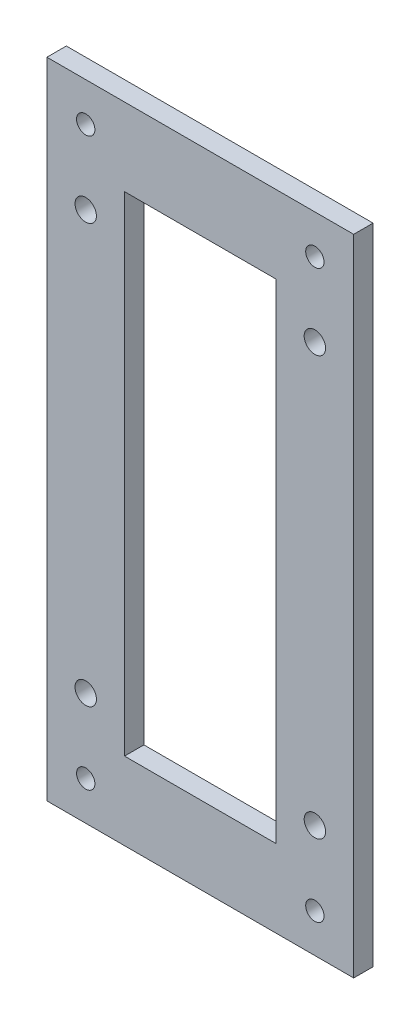
ISO-10303-21;
HEADER;
FILE_DESCRIPTION(('STEP AP214'),'2;1');
FILE_NAME('part.step','',(''),(''),'','','');
FILE_SCHEMA(('AUTOMOTIVE_DESIGN { 1 0 10303 214 1 1 1 1 }'));
ENDSEC;
DATA;
#1=APPLICATION_CONTEXT('core data for automotive mechanical design processes');
#2=APPLICATION_PROTOCOL_DEFINITION('international standard','automotive_design',2000,#1);
#3=PRODUCT_CONTEXT('',#1,'mechanical');
#4=PRODUCT('Part','Part','',(#3));
#5=PRODUCT_RELATED_PRODUCT_CATEGORY('part','',(#4));
#6=PRODUCT_DEFINITION_FORMATION('','',#4);
#7=PRODUCT_DEFINITION_CONTEXT('part definition',#1,'design');
#8=PRODUCT_DEFINITION('design','',#6,#7);
#9=PRODUCT_DEFINITION_SHAPE('','',#8);
#10=(LENGTH_UNIT() NAMED_UNIT(*) SI_UNIT(.MILLI.,.METRE.));
#11=(NAMED_UNIT(*) PLANE_ANGLE_UNIT() SI_UNIT($,.RADIAN.));
#12=(NAMED_UNIT(*) SI_UNIT($,.STERADIAN.) SOLID_ANGLE_UNIT());
#13=UNCERTAINTY_MEASURE_WITH_UNIT(LENGTH_MEASURE(1.E-05),#10,'distance_accuracy_value','');
#14=(GEOMETRIC_REPRESENTATION_CONTEXT(3) GLOBAL_UNCERTAINTY_ASSIGNED_CONTEXT((#13)) GLOBAL_UNIT_ASSIGNED_CONTEXT((#10,
#11,#12)) REPRESENTATION_CONTEXT('',''));
#15=CARTESIAN_POINT('',(0.,0.,0.));
#16=DIRECTION('',(0.,0.,1.));
#17=DIRECTION('',(1.,0.,0.));
#18=AXIS2_PLACEMENT_3D('',#15,#16,#17);
#19=CARTESIAN_POINT('',(0.,0.,6.35));
#20=DIRECTION('',(0.,0.,-1.));
#21=DIRECTION('',(-1.,0.,0.));
#22=AXIS2_PLACEMENT_3D('',#19,#20,#21);
#23=PLANE('',#22);
#24=CARTESIAN_POINT('',(12.7,36.9,6.35));
#25=DIRECTION('',(0.,0.,1.));
#26=DIRECTION('',(-1.,0.,0.));
#27=AXIS2_PLACEMENT_3D('',#24,#25,#26);
#28=CIRCLE('',#27,3.49999999999997);
#29=CARTESIAN_POINT('',(9.20000000000005,36.9,6.35));
#30=VERTEX_POINT('',#29);
#31=EDGE_CURVE('E431',#30,#30,#28,.T.);
#32=ORIENTED_EDGE('',*,*,#31,.F.);
#33=EDGE_LOOP('',(#32));
#34=FACE_BOUND('',#33,.T.);
#35=CARTESIAN_POINT('',(87.7,36.9,6.35));
#36=DIRECTION('',(0.,0.,1.));
#37=DIRECTION('',(1.,0.,0.));
#38=AXIS2_PLACEMENT_3D('',#35,#36,#37);
#39=CIRCLE('',#38,3.49999999999991);
#40=CARTESIAN_POINT('',(91.1999999999999,36.9,6.35));
#41=VERTEX_POINT('',#40);
#42=EDGE_CURVE('E425',#41,#41,#39,.T.);
#43=ORIENTED_EDGE('',*,*,#42,.F.);
#44=EDGE_LOOP('',(#43));
#45=FACE_BOUND('',#44,.T.);
#46=CARTESIAN_POINT('',(87.7,173.9,6.35));
#47=DIRECTION('',(0.,0.,1.));
#48=DIRECTION('',(-1.,0.,0.));
#49=AXIS2_PLACEMENT_3D('',#46,#47,#48);
#50=CIRCLE('',#49,3.49999999999991);
#51=CARTESIAN_POINT('',(84.2,173.9,6.35));
#52=VERTEX_POINT('',#51);
#53=EDGE_CURVE('E422',#52,#52,#50,.T.);
#54=ORIENTED_EDGE('',*,*,#53,.F.);
#55=EDGE_LOOP('',(#54));
#56=FACE_BOUND('',#55,.T.);
#57=CARTESIAN_POINT('',(12.7,173.9,6.35));
#58=DIRECTION('',(0.,0.,1.));
#59=DIRECTION('',(1.,0.,0.));
#60=AXIS2_PLACEMENT_3D('',#57,#58,#59);
#61=CIRCLE('',#60,3.5);
#62=CARTESIAN_POINT('',(16.2,173.9,6.35));
#63=VERTEX_POINT('',#62);
#64=EDGE_CURVE('E198',#63,#63,#61,.T.);
#65=ORIENTED_EDGE('',*,*,#64,.F.);
#66=EDGE_LOOP('',(#65));
#67=FACE_BOUND('',#66,.T.);
#68=CARTESIAN_POINT('',(12.7027343498681,12.7,6.35));
#69=DIRECTION('',(0.,0.,1.));
#70=DIRECTION('',(-1.,0.,0.));
#71=AXIS2_PLACEMENT_3D('',#68,#69,#70);
#72=CIRCLE('',#71,3.);
#73=CARTESIAN_POINT('',(9.70273434986813,12.7,6.35));
#74=VERTEX_POINT('',#73);
#75=EDGE_CURVE('E208',#74,#74,#72,.T.);
#76=ORIENTED_EDGE('',*,*,#75,.F.);
#77=EDGE_LOOP('',(#76));
#78=FACE_BOUND('',#77,.T.);
#79=CARTESIAN_POINT('',(87.6972656501319,12.7,6.35));
#80=DIRECTION('',(0.,0.,1.));
#81=DIRECTION('',(1.,0.,0.));
#82=AXIS2_PLACEMENT_3D('',#79,#80,#81);
#83=CIRCLE('',#82,3.00000000000001);
#84=CARTESIAN_POINT('',(90.6972656501319,12.7,6.35));
#85=VERTEX_POINT('',#84);
#86=EDGE_CURVE('E219',#85,#85,#83,.T.);
#87=ORIENTED_EDGE('',*,*,#86,.F.);
#88=EDGE_LOOP('',(#87));
#89=FACE_BOUND('',#88,.T.);
#90=CARTESIAN_POINT('',(87.6972656501318,198.1,6.35));
#91=DIRECTION('',(0.,0.,1.));
#92=DIRECTION('',(-1.,0.,0.));
#93=AXIS2_PLACEMENT_3D('',#90,#91,#92);
#94=CIRCLE('',#93,3.00000000000001);
#95=CARTESIAN_POINT('',(84.6972656501318,198.1,6.35));
#96=VERTEX_POINT('',#95);
#97=EDGE_CURVE('E233',#96,#96,#94,.T.);
#98=ORIENTED_EDGE('',*,*,#97,.F.);
#99=EDGE_LOOP('',(#98));
#100=FACE_BOUND('',#99,.T.);
#101=CARTESIAN_POINT('',(12.7027343498681,198.1,6.35));
#102=DIRECTION('',(0.,0.,1.));
#103=DIRECTION('',(1.,0.,0.));
#104=AXIS2_PLACEMENT_3D('',#101,#102,#103);
#105=CIRCLE('',#104,3.);
#106=CARTESIAN_POINT('',(15.7027343498681,198.1,6.35));
#107=VERTEX_POINT('',#106);
#108=EDGE_CURVE('E225',#107,#107,#105,.T.);
#109=ORIENTED_EDGE('',*,*,#108,.F.);
#110=EDGE_LOOP('',(#109));
#111=FACE_BOUND('',#110,.T.);
#112=DIRECTION('',(0.,-1.,0.));
#113=VECTOR('',#112,1.);
#114=CARTESIAN_POINT('',(0.,0.,6.35));
#115=LINE('',#114,#113);
#116=CARTESIAN_POINT('',(0.,210.8,6.35));
#117=VERTEX_POINT('',#116);
#118=CARTESIAN_POINT('',(0.,0.,6.35));
#119=VERTEX_POINT('',#118);
#120=EDGE_CURVE('E157',#117,#119,#115,.T.);
#121=ORIENTED_EDGE('',*,*,#120,.T.);
#122=DIRECTION('',(1.,0.,0.));
#123=VECTOR('',#122,1.);
#124=CARTESIAN_POINT('',(0.,0.,6.35));
#125=LINE('',#124,#123);
#126=CARTESIAN_POINT('',(100.4,0.,6.35));
#127=VERTEX_POINT('',#126);
#128=EDGE_CURVE('E161',#119,#127,#125,.T.);
#129=ORIENTED_EDGE('',*,*,#128,.T.);
#130=DIRECTION('',(0.,1.,0.));
#131=VECTOR('',#130,1.);
#132=CARTESIAN_POINT('',(100.4,0.,6.35));
#133=LINE('',#132,#131);
#134=CARTESIAN_POINT('',(100.4,210.8,6.35));
#135=VERTEX_POINT('',#134);
#136=EDGE_CURVE('E165',#127,#135,#133,.T.);
#137=ORIENTED_EDGE('',*,*,#136,.T.);
#138=DIRECTION('',(-1.,0.,0.));
#139=VECTOR('',#138,1.);
#140=CARTESIAN_POINT('',(0.,210.8,6.35));
#141=LINE('',#140,#139);
#142=EDGE_CURVE('E168',#135,#117,#141,.T.);
#143=ORIENTED_EDGE('',*,*,#142,.T.);
#144=EDGE_LOOP('',(#121,#129,#137,#143));
#145=FACE_BOUND('',#144,.T.);
#146=DIRECTION('',(0.,-1.,0.));
#147=VECTOR('',#146,1.);
#148=CARTESIAN_POINT('',(25.4,185.4,6.35));
#149=LINE('',#148,#147);
#150=CARTESIAN_POINT('',(25.4,185.4,6.35));
#151=VERTEX_POINT('',#150);
#152=CARTESIAN_POINT('',(25.4,25.4,6.35));
#153=VERTEX_POINT('',#152);
#154=EDGE_CURVE('E107',#151,#153,#149,.T.);
#155=ORIENTED_EDGE('',*,*,#154,.F.);
#156=DIRECTION('',(-1.,0.,0.));
#157=VECTOR('',#156,1.);
#158=CARTESIAN_POINT('',(25.4,185.4,6.35));
#159=LINE('',#158,#157);
#160=CARTESIAN_POINT('',(75.,185.4,6.35));
#161=VERTEX_POINT('',#160);
#162=EDGE_CURVE('E133',#161,#151,#159,.T.);
#163=ORIENTED_EDGE('',*,*,#162,.F.);
#164=DIRECTION('',(0.,1.,0.));
#165=VECTOR('',#164,1.);
#166=CARTESIAN_POINT('',(75.,185.4,6.35));
#167=LINE('',#166,#165);
#168=CARTESIAN_POINT('',(75.,25.4,6.35));
#169=VERTEX_POINT('',#168);
#170=EDGE_CURVE('E129',#169,#161,#167,.T.);
#171=ORIENTED_EDGE('',*,*,#170,.F.);
#172=DIRECTION('',(1.,0.,0.));
#173=VECTOR('',#172,1.);
#174=CARTESIAN_POINT('',(25.4,25.4,6.35));
#175=LINE('',#174,#173);
#176=EDGE_CURVE('E116',#153,#169,#175,.T.);
#177=ORIENTED_EDGE('',*,*,#176,.F.);
#178=EDGE_LOOP('',(#155,#163,#171,#177));
#179=FACE_BOUND('',#178,.T.);
#180=ADVANCED_FACE('F39',(#34,#45,#56,#67,#78,#89,#100,#111,#145,#179),#23,.F.);
#181=CARTESIAN_POINT('',(0.,0.,0.));
#182=DIRECTION('',(0.,0.,-1.));
#183=DIRECTION('',(-1.,0.,0.));
#184=AXIS2_PLACEMENT_3D('',#181,#182,#183);
#185=PLANE('',#184);
#186=CARTESIAN_POINT('',(12.7,36.9,0.));
#187=DIRECTION('',(0.,0.,-1.));
#188=DIRECTION('',(-1.,0.,0.));
#189=AXIS2_PLACEMENT_3D('',#186,#187,#188);
#190=CIRCLE('',#189,3.49999999999997);
#191=CARTESIAN_POINT('',(9.20000000000005,36.9,0.));
#192=VERTEX_POINT('',#191);
#193=EDGE_CURVE('E43',#192,#192,#190,.T.);
#194=ORIENTED_EDGE('',*,*,#193,.F.);
#195=EDGE_LOOP('',(#194));
#196=FACE_BOUND('',#195,.T.);
#197=CARTESIAN_POINT('',(87.7,36.9,0.));
#198=DIRECTION('',(0.,0.,-1.));
#199=DIRECTION('',(-1.,0.,0.));
#200=AXIS2_PLACEMENT_3D('',#197,#198,#199);
#201=CIRCLE('',#200,3.49999999999991);
#202=CARTESIAN_POINT('',(84.2000000000001,36.9,0.));
#203=VERTEX_POINT('',#202);
#204=EDGE_CURVE('E201',#203,#203,#201,.T.);
#205=ORIENTED_EDGE('',*,*,#204,.F.);
#206=EDGE_LOOP('',(#205));
#207=FACE_BOUND('',#206,.T.);
#208=CARTESIAN_POINT('',(87.7,173.9,0.));
#209=DIRECTION('',(0.,0.,-1.));
#210=DIRECTION('',(-1.,0.,0.));
#211=AXIS2_PLACEMENT_3D('',#208,#209,#210);
#212=CIRCLE('',#211,3.49999999999991);
#213=CARTESIAN_POINT('',(84.2,173.9,0.));
#214=VERTEX_POINT('',#213);
#215=EDGE_CURVE('E197',#214,#214,#212,.T.);
#216=ORIENTED_EDGE('',*,*,#215,.F.);
#217=EDGE_LOOP('',(#216));
#218=FACE_BOUND('',#217,.T.);
#219=CARTESIAN_POINT('',(12.7,173.9,0.));
#220=DIRECTION('',(0.,0.,-1.));
#221=DIRECTION('',(-1.,0.,0.));
#222=AXIS2_PLACEMENT_3D('',#219,#220,#221);
#223=CIRCLE('',#222,3.5);
#224=CARTESIAN_POINT('',(9.19999999999996,173.9,0.));
#225=VERTEX_POINT('',#224);
#226=EDGE_CURVE('E193',#225,#225,#223,.T.);
#227=ORIENTED_EDGE('',*,*,#226,.F.);
#228=EDGE_LOOP('',(#227));
#229=FACE_BOUND('',#228,.T.);
#230=CARTESIAN_POINT('',(12.7027343498681,12.7,0.));
#231=DIRECTION('',(0.,0.,1.));
#232=DIRECTION('',(-1.,0.,0.));
#233=AXIS2_PLACEMENT_3D('',#230,#231,#232);
#234=CIRCLE('',#233,3.);
#235=CARTESIAN_POINT('',(9.70273434986813,12.7,0.));
#236=VERTEX_POINT('',#235);
#237=EDGE_CURVE('E213',#236,#236,#234,.T.);
#238=ORIENTED_EDGE('',*,*,#237,.T.);
#239=EDGE_LOOP('',(#238));
#240=FACE_BOUND('',#239,.T.);
#241=CARTESIAN_POINT('',(87.6972656501319,12.7,0.));
#242=DIRECTION('',(0.,0.,1.));
#243=DIRECTION('',(1.,0.,0.));
#244=AXIS2_PLACEMENT_3D('',#241,#242,#243);
#245=CIRCLE('',#244,3.00000000000001);
#246=CARTESIAN_POINT('',(90.6972656501319,12.7,0.));
#247=VERTEX_POINT('',#246);
#248=EDGE_CURVE('E239',#247,#247,#245,.T.);
#249=ORIENTED_EDGE('',*,*,#248,.T.);
#250=EDGE_LOOP('',(#249));
#251=FACE_BOUND('',#250,.T.);
#252=CARTESIAN_POINT('',(87.6972656501318,198.1,0.));
#253=DIRECTION('',(0.,0.,1.));
#254=DIRECTION('',(-1.,0.,0.));
#255=AXIS2_PLACEMENT_3D('',#252,#253,#254);
#256=CIRCLE('',#255,3.00000000000001);
#257=CARTESIAN_POINT('',(84.6972656501318,198.1,0.));
#258=VERTEX_POINT('',#257);
#259=EDGE_CURVE('E228',#258,#258,#256,.T.);
#260=ORIENTED_EDGE('',*,*,#259,.T.);
#261=EDGE_LOOP('',(#260));
#262=FACE_BOUND('',#261,.T.);
#263=CARTESIAN_POINT('',(12.7027343498681,198.1,0.));
#264=DIRECTION('',(0.,0.,1.));
#265=DIRECTION('',(1.,0.,0.));
#266=AXIS2_PLACEMENT_3D('',#263,#264,#265);
#267=CIRCLE('',#266,3.);
#268=CARTESIAN_POINT('',(15.7027343498681,198.1,0.));
#269=VERTEX_POINT('',#268);
#270=EDGE_CURVE('E141',#269,#269,#267,.T.);
#271=ORIENTED_EDGE('',*,*,#270,.T.);
#272=EDGE_LOOP('',(#271));
#273=FACE_BOUND('',#272,.T.);
#274=DIRECTION('',(0.,-1.,0.));
#275=VECTOR('',#274,1.);
#276=CARTESIAN_POINT('',(0.,0.,0.));
#277=LINE('',#276,#275);
#278=CARTESIAN_POINT('',(0.,210.8,0.));
#279=VERTEX_POINT('',#278);
#280=CARTESIAN_POINT('',(0.,0.,0.));
#281=VERTEX_POINT('',#280);
#282=EDGE_CURVE('E125',#279,#281,#277,.T.);
#283=ORIENTED_EDGE('',*,*,#282,.F.);
#284=DIRECTION('',(-1.,0.,0.));
#285=VECTOR('',#284,1.);
#286=CARTESIAN_POINT('',(0.,210.8,0.));
#287=LINE('',#286,#285);
#288=CARTESIAN_POINT('',(100.4,210.8,0.));
#289=VERTEX_POINT('',#288);
#290=EDGE_CURVE('E162',#289,#279,#287,.T.);
#291=ORIENTED_EDGE('',*,*,#290,.F.);
#292=DIRECTION('',(0.,1.,0.));
#293=VECTOR('',#292,1.);
#294=CARTESIAN_POINT('',(100.4,0.,0.));
#295=LINE('',#294,#293);
#296=CARTESIAN_POINT('',(100.4,0.,0.));
#297=VERTEX_POINT('',#296);
#298=EDGE_CURVE('E178',#297,#289,#295,.T.);
#299=ORIENTED_EDGE('',*,*,#298,.F.);
#300=DIRECTION('',(1.,0.,0.));
#301=VECTOR('',#300,1.);
#302=CARTESIAN_POINT('',(0.,0.,0.));
#303=LINE('',#302,#301);
#304=EDGE_CURVE('E175',#281,#297,#303,.T.);
#305=ORIENTED_EDGE('',*,*,#304,.F.);
#306=EDGE_LOOP('',(#283,#291,#299,#305));
#307=FACE_BOUND('',#306,.T.);
#308=DIRECTION('',(-1.,0.,0.));
#309=VECTOR('',#308,1.);
#310=CARTESIAN_POINT('',(25.4,185.4,0.));
#311=LINE('',#310,#309);
#312=CARTESIAN_POINT('',(75.,185.4,0.));
#313=VERTEX_POINT('',#312);
#314=CARTESIAN_POINT('',(25.4,185.4,0.));
#315=VERTEX_POINT('',#314);
#316=EDGE_CURVE('E117',#313,#315,#311,.T.);
#317=ORIENTED_EDGE('',*,*,#316,.T.);
#318=DIRECTION('',(0.,-1.,0.));
#319=VECTOR('',#318,1.);
#320=CARTESIAN_POINT('',(25.4,185.4,0.));
#321=LINE('',#320,#319);
#322=CARTESIAN_POINT('',(25.4,25.4,0.));
#323=VERTEX_POINT('',#322);
#324=EDGE_CURVE('E65',#315,#323,#321,.T.);
#325=ORIENTED_EDGE('',*,*,#324,.T.);
#326=DIRECTION('',(1.,0.,0.));
#327=VECTOR('',#326,1.);
#328=CARTESIAN_POINT('',(25.4,25.4,0.));
#329=LINE('',#328,#327);
#330=CARTESIAN_POINT('',(75.,25.4,0.));
#331=VERTEX_POINT('',#330);
#332=EDGE_CURVE('E123',#323,#331,#329,.T.);
#333=ORIENTED_EDGE('',*,*,#332,.T.);
#334=DIRECTION('',(0.,1.,0.));
#335=VECTOR('',#334,1.);
#336=CARTESIAN_POINT('',(75.,185.4,0.));
#337=LINE('',#336,#335);
#338=EDGE_CURVE('E144',#331,#313,#337,.T.);
#339=ORIENTED_EDGE('',*,*,#338,.T.);
#340=EDGE_LOOP('',(#317,#325,#333,#339));
#341=FACE_BOUND('',#340,.T.);
#342=ADVANCED_FACE('F254',(#196,#207,#218,#229,#240,#251,#262,#273,#307,#341),#185,.T.);
#343=CARTESIAN_POINT('',(0.,0.,6.35));
#344=DIRECTION('',(1.,0.,0.));
#345=DIRECTION('',(0.,0.,-1.));
#346=AXIS2_PLACEMENT_3D('',#343,#344,#345);
#347=PLANE('',#346);
#348=ORIENTED_EDGE('',*,*,#282,.T.);
#349=DIRECTION('',(0.,0.,-1.));
#350=VECTOR('',#349,1.);
#351=CARTESIAN_POINT('',(0.,0.,6.35));
#352=LINE('',#351,#350);
#353=EDGE_CURVE('E11',#119,#281,#352,.T.);
#354=ORIENTED_EDGE('',*,*,#353,.F.);
#355=ORIENTED_EDGE('',*,*,#120,.F.);
#356=DIRECTION('',(0.,0.,-1.));
#357=VECTOR('',#356,1.);
#358=CARTESIAN_POINT('',(0.,210.8,6.35));
#359=LINE('',#358,#357);
#360=EDGE_CURVE('E171',#117,#279,#359,.T.);
#361=ORIENTED_EDGE('',*,*,#360,.T.);
#362=EDGE_LOOP('',(#348,#354,#355,#361));
#363=FACE_BOUND('',#362,.T.);
#364=ADVANCED_FACE('F41',(#363),#347,.F.);
#365=CARTESIAN_POINT('',(0.,0.,6.35));
#366=DIRECTION('',(0.,1.,0.));
#367=DIRECTION('',(0.,0.,1.));
#368=AXIS2_PLACEMENT_3D('',#365,#366,#367);
#369=PLANE('',#368);
#370=ORIENTED_EDGE('',*,*,#304,.T.);
#371=DIRECTION('',(0.,0.,-1.));
#372=VECTOR('',#371,1.);
#373=CARTESIAN_POINT('',(100.4,0.,6.35));
#374=LINE('',#373,#372);
#375=EDGE_CURVE('E49',#127,#297,#374,.T.);
#376=ORIENTED_EDGE('',*,*,#375,.F.);
#377=ORIENTED_EDGE('',*,*,#128,.F.);
#378=ORIENTED_EDGE('',*,*,#353,.T.);
#379=EDGE_LOOP('',(#370,#376,#377,#378));
#380=FACE_BOUND('',#379,.T.);
#381=ADVANCED_FACE('F268',(#380),#369,.F.);
#382=CARTESIAN_POINT('',(100.4,0.,6.35));
#383=DIRECTION('',(-1.,0.,0.));
#384=DIRECTION('',(0.,0.,1.));
#385=AXIS2_PLACEMENT_3D('',#382,#383,#384);
#386=PLANE('',#385);
#387=ORIENTED_EDGE('',*,*,#298,.T.);
#388=DIRECTION('',(0.,0.,-1.));
#389=VECTOR('',#388,1.);
#390=CARTESIAN_POINT('',(100.4,210.8,6.35));
#391=LINE('',#390,#389);
#392=EDGE_CURVE('E186',#135,#289,#391,.T.);
#393=ORIENTED_EDGE('',*,*,#392,.F.);
#394=ORIENTED_EDGE('',*,*,#136,.F.);
#395=ORIENTED_EDGE('',*,*,#375,.T.);
#396=EDGE_LOOP('',(#387,#393,#394,#395));
#397=FACE_BOUND('',#396,.T.);
#398=ADVANCED_FACE('F273',(#397),#386,.F.);
#399=CARTESIAN_POINT('',(0.,210.8,6.35));
#400=DIRECTION('',(0.,-1.,0.));
#401=DIRECTION('',(0.,0.,-1.));
#402=AXIS2_PLACEMENT_3D('',#399,#400,#401);
#403=PLANE('',#402);
#404=ORIENTED_EDGE('',*,*,#290,.T.);
#405=ORIENTED_EDGE('',*,*,#360,.F.);
#406=ORIENTED_EDGE('',*,*,#142,.F.);
#407=ORIENTED_EDGE('',*,*,#392,.T.);
#408=EDGE_LOOP('',(#404,#405,#406,#407));
#409=FACE_BOUND('',#408,.T.);
#410=ADVANCED_FACE('F276',(#409),#403,.F.);
#411=CARTESIAN_POINT('',(25.4,185.4,6.35));
#412=DIRECTION('',(1.,0.,0.));
#413=DIRECTION('',(0.,1.,0.));
#414=AXIS2_PLACEMENT_3D('',#411,#412,#413);
#415=PLANE('',#414);
#416=ORIENTED_EDGE('',*,*,#324,.F.);
#417=DIRECTION('',(0.,0.,-1.));
#418=VECTOR('',#417,1.);
#419=CARTESIAN_POINT('',(25.4,185.4,6.35));
#420=LINE('',#419,#418);
#421=EDGE_CURVE('E111',#151,#315,#420,.T.);
#422=ORIENTED_EDGE('',*,*,#421,.F.);
#423=ORIENTED_EDGE('',*,*,#154,.T.);
#424=DIRECTION('',(0.,0.,-1.));
#425=VECTOR('',#424,1.);
#426=CARTESIAN_POINT('',(25.4,25.4,6.35));
#427=LINE('',#426,#425);
#428=EDGE_CURVE('E110',#153,#323,#427,.T.);
#429=ORIENTED_EDGE('',*,*,#428,.T.);
#430=EDGE_LOOP('',(#416,#422,#423,#429));
#431=FACE_BOUND('',#430,.T.);
#432=ADVANCED_FACE('F109',(#431),#415,.T.);
#433=CARTESIAN_POINT('',(25.4,25.4,6.35));
#434=DIRECTION('',(0.,1.,0.));
#435=DIRECTION('',(0.,0.,1.));
#436=AXIS2_PLACEMENT_3D('',#433,#434,#435);
#437=PLANE('',#436);
#438=ORIENTED_EDGE('',*,*,#332,.F.);
#439=ORIENTED_EDGE('',*,*,#428,.F.);
#440=ORIENTED_EDGE('',*,*,#176,.T.);
#441=DIRECTION('',(0.,0.,-1.));
#442=VECTOR('',#441,1.);
#443=CARTESIAN_POINT('',(75.,25.4,6.35));
#444=LINE('',#443,#442);
#445=EDGE_CURVE('E126',#169,#331,#444,.T.);
#446=ORIENTED_EDGE('',*,*,#445,.T.);
#447=EDGE_LOOP('',(#438,#439,#440,#446));
#448=FACE_BOUND('',#447,.T.);
#449=ADVANCED_FACE('F120',(#448),#437,.T.);
#450=CARTESIAN_POINT('',(75.,185.4,6.35));
#451=DIRECTION('',(-1.,0.,0.));
#452=DIRECTION('',(0.,-1.,0.));
#453=AXIS2_PLACEMENT_3D('',#450,#451,#452);
#454=PLANE('',#453);
#455=ORIENTED_EDGE('',*,*,#338,.F.);
#456=ORIENTED_EDGE('',*,*,#445,.F.);
#457=ORIENTED_EDGE('',*,*,#170,.T.);
#458=DIRECTION('',(0.,0.,-1.));
#459=VECTOR('',#458,1.);
#460=CARTESIAN_POINT('',(75.,185.4,6.35));
#461=LINE('',#460,#459);
#462=EDGE_CURVE('E57',#161,#313,#461,.T.);
#463=ORIENTED_EDGE('',*,*,#462,.T.);
#464=EDGE_LOOP('',(#455,#456,#457,#463));
#465=FACE_BOUND('',#464,.T.);
#466=ADVANCED_FACE('F286',(#465),#454,.T.);
#467=CARTESIAN_POINT('',(25.4,185.4,6.35));
#468=DIRECTION('',(0.,-1.,0.));
#469=DIRECTION('',(0.,0.,-1.));
#470=AXIS2_PLACEMENT_3D('',#467,#468,#469);
#471=PLANE('',#470);
#472=ORIENTED_EDGE('',*,*,#316,.F.);
#473=ORIENTED_EDGE('',*,*,#462,.F.);
#474=ORIENTED_EDGE('',*,*,#162,.T.);
#475=ORIENTED_EDGE('',*,*,#421,.T.);
#476=EDGE_LOOP('',(#472,#473,#474,#475));
#477=FACE_BOUND('',#476,.T.);
#478=ADVANCED_FACE('F283',(#477),#471,.T.);
#479=CARTESIAN_POINT('',(12.7027343498681,198.1,0.));
#480=DIRECTION('',(0.,0.,1.));
#481=DIRECTION('',(1.,0.,0.));
#482=AXIS2_PLACEMENT_3D('',#479,#480,#481);
#483=CYLINDRICAL_SURFACE('',#482,3.);
#484=ORIENTED_EDGE('',*,*,#270,.F.);
#485=EDGE_LOOP('',(#484));
#486=FACE_BOUND('',#485,.T.);
#487=ORIENTED_EDGE('',*,*,#108,.T.);
#488=EDGE_LOOP('',(#487));
#489=FACE_BOUND('',#488,.T.);
#490=ADVANCED_FACE('F285',(#486,#489),#483,.F.);
#491=CARTESIAN_POINT('',(87.6972656501318,198.1,0.));
#492=DIRECTION('',(0.,0.,1.));
#493=DIRECTION('',(1.,0.,0.));
#494=AXIS2_PLACEMENT_3D('',#491,#492,#493);
#495=CYLINDRICAL_SURFACE('',#494,3.00000000000001);
#496=ORIENTED_EDGE('',*,*,#259,.F.);
#497=EDGE_LOOP('',(#496));
#498=FACE_BOUND('',#497,.T.);
#499=ORIENTED_EDGE('',*,*,#97,.T.);
#500=EDGE_LOOP('',(#499));
#501=FACE_BOUND('',#500,.T.);
#502=ADVANCED_FACE('F292',(#498,#501),#495,.F.);
#503=CARTESIAN_POINT('',(87.6972656501319,12.7,0.));
#504=DIRECTION('',(0.,0.,1.));
#505=DIRECTION('',(1.,0.,0.));
#506=AXIS2_PLACEMENT_3D('',#503,#504,#505);
#507=CYLINDRICAL_SURFACE('',#506,3.00000000000001);
#508=ORIENTED_EDGE('',*,*,#248,.F.);
#509=EDGE_LOOP('',(#508));
#510=FACE_BOUND('',#509,.T.);
#511=ORIENTED_EDGE('',*,*,#86,.T.);
#512=EDGE_LOOP('',(#511));
#513=FACE_BOUND('',#512,.T.);
#514=ADVANCED_FACE('F250',(#510,#513),#507,.F.);
#515=CARTESIAN_POINT('',(12.7027343498681,12.7,0.));
#516=DIRECTION('',(0.,0.,1.));
#517=DIRECTION('',(1.,0.,0.));
#518=AXIS2_PLACEMENT_3D('',#515,#516,#517);
#519=CYLINDRICAL_SURFACE('',#518,3.);
#520=ORIENTED_EDGE('',*,*,#237,.F.);
#521=EDGE_LOOP('',(#520));
#522=FACE_BOUND('',#521,.T.);
#523=ORIENTED_EDGE('',*,*,#75,.T.);
#524=EDGE_LOOP('',(#523));
#525=FACE_BOUND('',#524,.T.);
#526=ADVANCED_FACE('F326',(#522,#525),#519,.F.);
#527=CARTESIAN_POINT('',(12.7,173.9,-3.65));
#528=DIRECTION('',(0.,0.,1.));
#529=DIRECTION('',(1.,0.,0.));
#530=AXIS2_PLACEMENT_3D('',#527,#528,#529);
#531=CYLINDRICAL_SURFACE('',#530,3.5);
#532=ORIENTED_EDGE('',*,*,#226,.T.);
#533=EDGE_LOOP('',(#532));
#534=FACE_BOUND('',#533,.T.);
#535=ORIENTED_EDGE('',*,*,#64,.T.);
#536=EDGE_LOOP('',(#535));
#537=FACE_BOUND('',#536,.T.);
#538=ADVANCED_FACE('F331',(#534,#537),#531,.F.);
#539=CARTESIAN_POINT('',(87.7,173.9,-3.65));
#540=DIRECTION('',(0.,0.,1.));
#541=DIRECTION('',(1.,0.,0.));
#542=AXIS2_PLACEMENT_3D('',#539,#540,#541);
#543=CYLINDRICAL_SURFACE('',#542,3.49999999999991);
#544=ORIENTED_EDGE('',*,*,#215,.T.);
#545=EDGE_LOOP('',(#544));
#546=FACE_BOUND('',#545,.T.);
#547=ORIENTED_EDGE('',*,*,#53,.T.);
#548=EDGE_LOOP('',(#547));
#549=FACE_BOUND('',#548,.T.);
#550=ADVANCED_FACE('F406',(#546,#549),#543,.F.);
#551=CARTESIAN_POINT('',(87.7,36.9,-3.65));
#552=DIRECTION('',(0.,0.,1.));
#553=DIRECTION('',(1.,0.,0.));
#554=AXIS2_PLACEMENT_3D('',#551,#552,#553);
#555=CYLINDRICAL_SURFACE('',#554,3.49999999999991);
#556=ORIENTED_EDGE('',*,*,#204,.T.);
#557=EDGE_LOOP('',(#556));
#558=FACE_BOUND('',#557,.T.);
#559=ORIENTED_EDGE('',*,*,#42,.T.);
#560=EDGE_LOOP('',(#559));
#561=FACE_BOUND('',#560,.T.);
#562=ADVANCED_FACE('F411',(#558,#561),#555,.F.);
#563=CARTESIAN_POINT('',(12.7,36.9,-3.65));
#564=DIRECTION('',(0.,0.,1.));
#565=DIRECTION('',(1.,0.,0.));
#566=AXIS2_PLACEMENT_3D('',#563,#564,#565);
#567=CYLINDRICAL_SURFACE('',#566,3.49999999999997);
#568=ORIENTED_EDGE('',*,*,#193,.T.);
#569=EDGE_LOOP('',(#568));
#570=FACE_BOUND('',#569,.T.);
#571=ORIENTED_EDGE('',*,*,#31,.T.);
#572=EDGE_LOOP('',(#571));
#573=FACE_BOUND('',#572,.T.);
#574=ADVANCED_FACE('F408',(#570,#573),#567,.F.);
#575=CLOSED_SHELL('',(#180,#342,#364,#381,#398,#410,#432,#449,#466,#478,#490,#502,#514,#526,
#538,#550,#562,#574));
#576=MANIFOLD_SOLID_BREP('B2',#575);
#577=ADVANCED_BREP_SHAPE_REPRESENTATION('',(#18,#576),#14);
#578=SHAPE_DEFINITION_REPRESENTATION(#9,#577);
ENDSEC;
END-ISO-10303-21;
